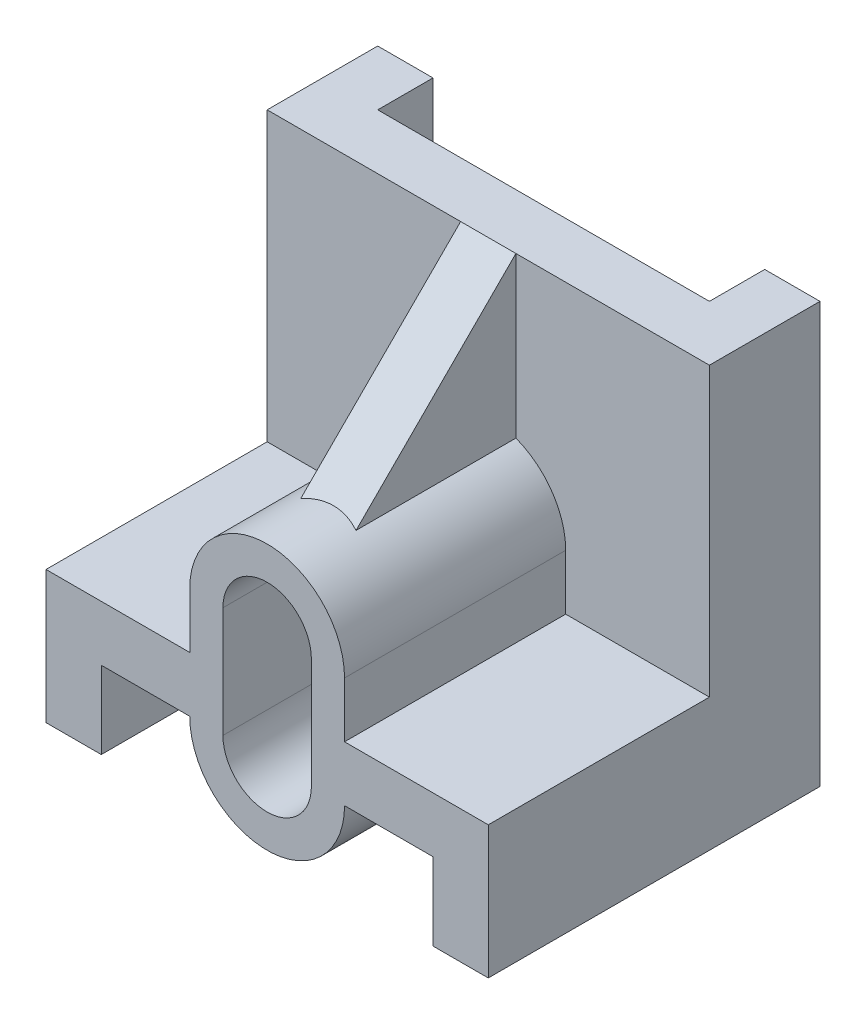
ISO-10303-21;
HEADER;
FILE_DESCRIPTION(('STEP AP214'),'2;1');
FILE_NAME('part.step','',(''),(''),'','','');
FILE_SCHEMA(('AUTOMOTIVE_DESIGN { 1 0 10303 214 1 1 1 1 }'));
ENDSEC;
DATA;
#1=APPLICATION_CONTEXT('core data for automotive mechanical design processes');
#2=APPLICATION_PROTOCOL_DEFINITION('international standard','automotive_design',2000,#1);
#3=PRODUCT_CONTEXT('',#1,'mechanical');
#4=PRODUCT('Part','Part','',(#3));
#5=PRODUCT_RELATED_PRODUCT_CATEGORY('part','',(#4));
#6=PRODUCT_DEFINITION_FORMATION('','',#4);
#7=PRODUCT_DEFINITION_CONTEXT('part definition',#1,'design');
#8=PRODUCT_DEFINITION('design','',#6,#7);
#9=PRODUCT_DEFINITION_SHAPE('','',#8);
#10=(LENGTH_UNIT() NAMED_UNIT(*) SI_UNIT(.MILLI.,.METRE.));
#11=(NAMED_UNIT(*) PLANE_ANGLE_UNIT() SI_UNIT($,.RADIAN.));
#12=(NAMED_UNIT(*) SI_UNIT($,.STERADIAN.) SOLID_ANGLE_UNIT());
#13=UNCERTAINTY_MEASURE_WITH_UNIT(LENGTH_MEASURE(1.E-05),#10,'distance_accuracy_value','');
#14=(GEOMETRIC_REPRESENTATION_CONTEXT(3) GLOBAL_UNCERTAINTY_ASSIGNED_CONTEXT((#13)) GLOBAL_UNIT_ASSIGNED_CONTEXT((#10,
#11,#12)) REPRESENTATION_CONTEXT('',''));
#15=CARTESIAN_POINT('',(0.,0.,0.));
#16=DIRECTION('',(0.,0.,1.));
#17=DIRECTION('',(1.,0.,0.));
#18=AXIS2_PLACEMENT_3D('',#15,#16,#17);
#19=CARTESIAN_POINT('',(20.,12.,10.));
#20=DIRECTION('',(0.,0.,-1.));
#21=DIRECTION('',(0.,1.,0.));
#22=AXIS2_PLACEMENT_3D('',#19,#20,#21);
#23=PLANE('',#22);
#24=DIRECTION('',(0.,-1.,0.));
#25=VECTOR('',#24,1.);
#26=CARTESIAN_POINT('',(-2.5,12.,10.));
#27=LINE('',#26,#25);
#28=CARTESIAN_POINT('',(-2.5,38.,10.));
#29=VERTEX_POINT('',#28);
#30=CARTESIAN_POINT('',(-2.5,23.538348415311,10.));
#31=VERTEX_POINT('',#30);
#32=EDGE_CURVE('E51',#29,#31,#27,.T.);
#33=ORIENTED_EDGE('',*,*,#32,.F.);
#34=DIRECTION('',(-1.,0.,0.));
#35=VECTOR('',#34,1.);
#36=CARTESIAN_POINT('',(20.,38.,10.));
#37=LINE('',#36,#35);
#38=CARTESIAN_POINT('',(-20.,38.,10.));
#39=VERTEX_POINT('',#38);
#40=EDGE_CURVE('E224',#29,#39,#37,.T.);
#41=ORIENTED_EDGE('',*,*,#40,.T.);
#42=DIRECTION('',(0.,-1.,0.));
#43=VECTOR('',#42,1.);
#44=CARTESIAN_POINT('',(-20.,12.,10.));
#45=LINE('',#44,#43);
#46=CARTESIAN_POINT('',(-20.,12.,10.));
#47=VERTEX_POINT('',#46);
#48=EDGE_CURVE('E267',#39,#47,#45,.T.);
#49=ORIENTED_EDGE('',*,*,#48,.T.);
#50=DIRECTION('',(-1.,0.,0.));
#51=VECTOR('',#50,1.);
#52=CARTESIAN_POINT('',(20.,12.,10.));
#53=LINE('',#52,#51);
#54=CARTESIAN_POINT('',(-7.,12.,10.));
#55=VERTEX_POINT('',#54);
#56=EDGE_CURVE('E235',#55,#47,#53,.T.);
#57=ORIENTED_EDGE('',*,*,#56,.F.);
#58=DIRECTION('',(0.,1.,0.));
#59=VECTOR('',#58,1.);
#60=CARTESIAN_POINT('',(-7.,12.,10.));
#61=LINE('',#60,#59);
#62=CARTESIAN_POINT('',(-7.,17.,9.99999999999999));
#63=VERTEX_POINT('',#62);
#64=EDGE_CURVE('E313',#55,#63,#61,.T.);
#65=ORIENTED_EDGE('',*,*,#64,.T.);
#66=CARTESIAN_POINT('',(0.,17.,10.));
#67=DIRECTION('',(0.,0.,-1.));
#68=DIRECTION('',(0.,1.,0.));
#69=AXIS2_PLACEMENT_3D('',#66,#67,#68);
#70=CIRCLE('',#69,7.);
#71=EDGE_CURVE('E227',#63,#31,#70,.T.);
#72=ORIENTED_EDGE('',*,*,#71,.T.);
#73=EDGE_LOOP('',(#33,#41,#49,#57,#65,#72));
#74=FACE_BOUND('',#73,.T.);
#75=ADVANCED_FACE('F36',(#74),#23,.F.);
#76=CARTESIAN_POINT('',(20.,38.,0.));
#77=DIRECTION('',(0.,0.,1.));
#78=DIRECTION('',(0.,-1.,0.));
#79=AXIS2_PLACEMENT_3D('',#76,#77,#78);
#80=PLANE('',#79);
#81=DIRECTION('',(-1.,0.,0.));
#82=VECTOR('',#81,1.);
#83=CARTESIAN_POINT('',(20.,38.,0.));
#84=LINE('',#83,#82);
#85=CARTESIAN_POINT('',(-15.,38.,0.));
#86=VERTEX_POINT('',#85);
#87=CARTESIAN_POINT('',(-20.,38.,0.));
#88=VERTEX_POINT('',#87);
#89=EDGE_CURVE('E253',#86,#88,#84,.T.);
#90=ORIENTED_EDGE('',*,*,#89,.F.);
#91=DIRECTION('',(0.,-1.,0.));
#92=VECTOR('',#91,1.);
#93=CARTESIAN_POINT('',(-15.,0.,0.));
#94=LINE('',#93,#92);
#95=CARTESIAN_POINT('',(-15.,0.,0.));
#96=VERTEX_POINT('',#95);
#97=EDGE_CURVE('E294',#86,#96,#94,.T.);
#98=ORIENTED_EDGE('',*,*,#97,.T.);
#99=DIRECTION('',(-1.,0.,0.));
#100=VECTOR('',#99,1.);
#101=CARTESIAN_POINT('',(20.,0.,0.));
#102=LINE('',#101,#100);
#103=CARTESIAN_POINT('',(-20.,0.,0.));
#104=VERTEX_POINT('',#103);
#105=EDGE_CURVE('E249',#96,#104,#102,.T.);
#106=ORIENTED_EDGE('',*,*,#105,.T.);
#107=DIRECTION('',(0.,1.,0.));
#108=VECTOR('',#107,1.);
#109=CARTESIAN_POINT('',(-20.,38.,0.));
#110=LINE('',#109,#108);
#111=EDGE_CURVE('E254',#104,#88,#110,.T.);
#112=ORIENTED_EDGE('',*,*,#111,.T.);
#113=EDGE_LOOP('',(#90,#98,#106,#112));
#114=FACE_BOUND('',#113,.T.);
#115=ADVANCED_FACE('F449',(#114),#80,.F.);
#116=CARTESIAN_POINT('',(20.,12.,30.));
#117=DIRECTION('',(0.,-1.,0.));
#118=DIRECTION('',(0.,0.,-1.));
#119=AXIS2_PLACEMENT_3D('',#116,#117,#118);
#120=PLANE('',#119);
#121=CARTESIAN_POINT('',(20.,12.,10.));
#122=VERTEX_POINT('',#121);
#123=CARTESIAN_POINT('',(7.,12.,10.));
#124=VERTEX_POINT('',#123);
#125=EDGE_CURVE('E233',#122,#124,#53,.T.);
#126=ORIENTED_EDGE('',*,*,#125,.T.);
#127=DIRECTION('',(0.,0.,1.));
#128=VECTOR('',#127,1.);
#129=CARTESIAN_POINT('',(7.,12.,30.));
#130=LINE('',#129,#128);
#131=CARTESIAN_POINT('',(7.,12.,30.));
#132=VERTEX_POINT('',#131);
#133=EDGE_CURVE('E310',#124,#132,#130,.T.);
#134=ORIENTED_EDGE('',*,*,#133,.T.);
#135=DIRECTION('',(-1.,0.,0.));
#136=VECTOR('',#135,1.);
#137=CARTESIAN_POINT('',(20.,12.,30.));
#138=LINE('',#137,#136);
#139=CARTESIAN_POINT('',(20.,12.,30.));
#140=VERTEX_POINT('',#139);
#141=EDGE_CURVE('E238',#140,#132,#138,.T.);
#142=ORIENTED_EDGE('',*,*,#141,.F.);
#143=DIRECTION('',(0.,0.,1.));
#144=VECTOR('',#143,1.);
#145=CARTESIAN_POINT('',(20.,12.,30.));
#146=LINE('',#145,#144);
#147=EDGE_CURVE('E277',#122,#140,#146,.T.);
#148=ORIENTED_EDGE('',*,*,#147,.F.);
#149=EDGE_LOOP('',(#126,#134,#142,#148));
#150=FACE_BOUND('',#149,.T.);
#151=ADVANCED_FACE('F405',(#150),#120,.F.);
#152=CARTESIAN_POINT('',(-15.,7.,0.));
#153=DIRECTION('',(0.,1.,0.));
#154=DIRECTION('',(0.,0.,1.));
#155=AXIS2_PLACEMENT_3D('',#152,#153,#154);
#156=PLANE('',#155);
#157=DIRECTION('',(0.,0.,1.));
#158=VECTOR('',#157,1.);
#159=CARTESIAN_POINT('',(7.,7.,-27.7848879788996));
#160=LINE('',#159,#158);
#161=CARTESIAN_POINT('',(7.,7.,4.99999999999999));
#162=VERTEX_POINT('',#161);
#163=CARTESIAN_POINT('',(7.,7.,30.));
#164=VERTEX_POINT('',#163);
#165=EDGE_CURVE('E324',#162,#164,#160,.T.);
#166=ORIENTED_EDGE('',*,*,#165,.F.);
#167=DIRECTION('',(1.,0.,0.));
#168=VECTOR('',#167,1.);
#169=CARTESIAN_POINT('',(-15.,7.,5.));
#170=LINE('',#169,#168);
#171=CARTESIAN_POINT('',(15.,7.,5.));
#172=VERTEX_POINT('',#171);
#173=EDGE_CURVE('E59',#162,#172,#170,.T.);
#174=ORIENTED_EDGE('',*,*,#173,.T.);
#175=DIRECTION('',(0.,0.,1.));
#176=VECTOR('',#175,1.);
#177=CARTESIAN_POINT('',(15.,7.,0.));
#178=LINE('',#177,#176);
#179=CARTESIAN_POINT('',(15.,7.,30.));
#180=VERTEX_POINT('',#179);
#181=EDGE_CURVE('E288',#172,#180,#178,.T.);
#182=ORIENTED_EDGE('',*,*,#181,.T.);
#183=DIRECTION('',(-1.,0.,0.));
#184=VECTOR('',#183,1.);
#185=CARTESIAN_POINT('',(-15.,7.,30.));
#186=LINE('',#185,#184);
#187=EDGE_CURVE('E291',#180,#164,#186,.T.);
#188=ORIENTED_EDGE('',*,*,#187,.T.);
#189=EDGE_LOOP('',(#166,#174,#182,#188));
#190=FACE_BOUND('',#189,.T.);
#191=ADVANCED_FACE('F430',(#190),#156,.F.);
#192=CARTESIAN_POINT('',(20.,0.,0.));
#193=DIRECTION('',(0.,1.,0.));
#194=DIRECTION('',(0.,0.,1.));
#195=AXIS2_PLACEMENT_3D('',#192,#193,#194);
#196=PLANE('',#195);
#197=ORIENTED_EDGE('',*,*,#105,.F.);
#198=DIRECTION('',(0.,0.,1.));
#199=VECTOR('',#198,1.);
#200=CARTESIAN_POINT('',(-15.,0.,0.));
#201=LINE('',#200,#199);
#202=CARTESIAN_POINT('',(-15.,0.,30.));
#203=VERTEX_POINT('',#202);
#204=EDGE_CURVE('E283',#96,#203,#201,.T.);
#205=ORIENTED_EDGE('',*,*,#204,.T.);
#206=DIRECTION('',(-1.,0.,0.));
#207=VECTOR('',#206,1.);
#208=CARTESIAN_POINT('',(20.,0.,30.));
#209=LINE('',#208,#207);
#210=CARTESIAN_POINT('',(-20.,0.,30.));
#211=VERTEX_POINT('',#210);
#212=EDGE_CURVE('E245',#203,#211,#209,.T.);
#213=ORIENTED_EDGE('',*,*,#212,.T.);
#214=DIRECTION('',(0.,0.,-1.));
#215=VECTOR('',#214,1.);
#216=CARTESIAN_POINT('',(-20.,0.,0.));
#217=LINE('',#216,#215);
#218=EDGE_CURVE('E258',#211,#104,#217,.T.);
#219=ORIENTED_EDGE('',*,*,#218,.T.);
#220=EDGE_LOOP('',(#197,#205,#213,#219));
#221=FACE_BOUND('',#220,.T.);
#222=ADVANCED_FACE('F467',(#221),#196,.F.);
#223=CARTESIAN_POINT('',(20.,38.,10.));
#224=DIRECTION('',(0.,-1.,0.));
#225=DIRECTION('',(0.,0.,-1.));
#226=AXIS2_PLACEMENT_3D('',#223,#224,#225);
#227=PLANE('',#226);
#228=DIRECTION('',(0.,0.,-1.));
#229=VECTOR('',#228,1.);
#230=CARTESIAN_POINT('',(15.,38.,0.));
#231=LINE('',#230,#229);
#232=CARTESIAN_POINT('',(15.,38.,5.));
#233=VERTEX_POINT('',#232);
#234=CARTESIAN_POINT('',(15.,38.,0.));
#235=VERTEX_POINT('',#234);
#236=EDGE_CURVE('E373',#233,#235,#231,.T.);
#237=ORIENTED_EDGE('',*,*,#236,.F.);
#238=DIRECTION('',(1.,0.,0.));
#239=VECTOR('',#238,1.);
#240=CARTESIAN_POINT('',(-15.,38.,5.));
#241=LINE('',#240,#239);
#242=CARTESIAN_POINT('',(-15.,38.,5.));
#243=VERTEX_POINT('',#242);
#244=EDGE_CURVE('E378',#243,#233,#241,.T.);
#245=ORIENTED_EDGE('',*,*,#244,.F.);
#246=DIRECTION('',(0.,0.,1.));
#247=VECTOR('',#246,1.);
#248=CARTESIAN_POINT('',(-15.,38.,0.));
#249=LINE('',#248,#247);
#250=EDGE_CURVE('E215',#86,#243,#249,.T.);
#251=ORIENTED_EDGE('',*,*,#250,.F.);
#252=ORIENTED_EDGE('',*,*,#89,.T.);
#253=DIRECTION('',(0.,0.,1.));
#254=VECTOR('',#253,1.);
#255=CARTESIAN_POINT('',(-20.,38.,10.));
#256=LINE('',#255,#254);
#257=EDGE_CURVE('E232',#88,#39,#256,.T.);
#258=ORIENTED_EDGE('',*,*,#257,.T.);
#259=ORIENTED_EDGE('',*,*,#40,.F.);
#260=DIRECTION('',(1.,0.,0.));
#261=VECTOR('',#260,1.);
#262=CARTESIAN_POINT('',(20.,38.,10.));
#263=LINE('',#262,#261);
#264=CARTESIAN_POINT('',(2.5,38.,10.));
#265=VERTEX_POINT('',#264);
#266=EDGE_CURVE('E205',#29,#265,#263,.T.);
#267=ORIENTED_EDGE('',*,*,#266,.T.);
#268=CARTESIAN_POINT('',(20.,38.,10.));
#269=VERTEX_POINT('',#268);
#270=EDGE_CURVE('E44',#269,#265,#37,.T.);
#271=ORIENTED_EDGE('',*,*,#270,.F.);
#272=DIRECTION('',(0.,0.,1.));
#273=VECTOR('',#272,1.);
#274=CARTESIAN_POINT('',(20.,38.,10.));
#275=LINE('',#274,#273);
#276=CARTESIAN_POINT('',(20.,38.,0.));
#277=VERTEX_POINT('',#276);
#278=EDGE_CURVE('E257',#277,#269,#275,.T.);
#279=ORIENTED_EDGE('',*,*,#278,.F.);
#280=EDGE_CURVE('E250',#277,#235,#84,.T.);
#281=ORIENTED_EDGE('',*,*,#280,.T.);
#282=EDGE_LOOP('',(#237,#245,#251,#252,#258,#259,#267,#271,#279,#281));
#283=FACE_BOUND('',#282,.T.);
#284=ADVANCED_FACE('F38',(#283),#227,.F.);
#285=ORIENTED_EDGE('',*,*,#270,.T.);
#286=DIRECTION('',(0.,-1.,0.));
#287=VECTOR('',#286,1.);
#288=CARTESIAN_POINT('',(2.5,12.,10.));
#289=LINE('',#288,#287);
#290=CARTESIAN_POINT('',(2.5,23.538348415311,10.));
#291=VERTEX_POINT('',#290);
#292=EDGE_CURVE('E385',#265,#291,#289,.T.);
#293=ORIENTED_EDGE('',*,*,#292,.T.);
#294=CARTESIAN_POINT('',(7.,17.,9.99999999999999));
#295=VERTEX_POINT('',#294);
#296=EDGE_CURVE('E306',#291,#295,#70,.T.);
#297=ORIENTED_EDGE('',*,*,#296,.T.);
#298=DIRECTION('',(0.,-1.,0.));
#299=VECTOR('',#298,1.);
#300=CARTESIAN_POINT('',(7.,12.,10.));
#301=LINE('',#300,#299);
#302=EDGE_CURVE('E307',#295,#124,#301,.T.);
#303=ORIENTED_EDGE('',*,*,#302,.T.);
#304=ORIENTED_EDGE('',*,*,#125,.F.);
#305=DIRECTION('',(0.,-1.,0.));
#306=VECTOR('',#305,1.);
#307=CARTESIAN_POINT('',(20.,12.,10.));
#308=LINE('',#307,#306);
#309=EDGE_CURVE('E279',#269,#122,#308,.T.);
#310=ORIENTED_EDGE('',*,*,#309,.F.);
#311=EDGE_LOOP('',(#285,#293,#297,#303,#304,#310));
#312=FACE_BOUND('',#311,.T.);
#313=ADVANCED_FACE('F399',(#312),#23,.F.);
#314=CARTESIAN_POINT('',(-7.,12.,30.));
#315=VERTEX_POINT('',#314);
#316=CARTESIAN_POINT('',(-20.,12.,30.));
#317=VERTEX_POINT('',#316);
#318=EDGE_CURVE('E241',#315,#317,#138,.T.);
#319=ORIENTED_EDGE('',*,*,#318,.F.);
#320=DIRECTION('',(0.,0.,-1.));
#321=VECTOR('',#320,1.);
#322=CARTESIAN_POINT('',(-7.,12.,30.));
#323=LINE('',#322,#321);
#324=EDGE_CURVE('E315',#315,#55,#323,.T.);
#325=ORIENTED_EDGE('',*,*,#324,.T.);
#326=ORIENTED_EDGE('',*,*,#56,.T.);
#327=DIRECTION('',(0.,0.,1.));
#328=VECTOR('',#327,1.);
#329=CARTESIAN_POINT('',(-20.,12.,30.));
#330=LINE('',#329,#328);
#331=EDGE_CURVE('E264',#47,#317,#330,.T.);
#332=ORIENTED_EDGE('',*,*,#331,.T.);
#333=EDGE_LOOP('',(#319,#325,#326,#332));
#334=FACE_BOUND('',#333,.T.);
#335=ADVANCED_FACE('F460',(#334),#120,.F.);
#336=CARTESIAN_POINT('',(20.,0.,30.));
#337=DIRECTION('',(0.,0.,-1.));
#338=DIRECTION('',(-1.,0.,0.));
#339=AXIS2_PLACEMENT_3D('',#336,#337,#338);
#340=PLANE('',#339);
#341=CARTESIAN_POINT('',(0.,7.,30.));
#342=DIRECTION('',(0.,0.,1.));
#343=DIRECTION('',(1.,0.,0.));
#344=AXIS2_PLACEMENT_3D('',#341,#342,#343);
#345=CIRCLE('',#344,7.);
#346=CARTESIAN_POINT('',(-7.,7.,30.));
#347=VERTEX_POINT('',#346);
#348=EDGE_CURVE('E330',#347,#164,#345,.T.);
#349=ORIENTED_EDGE('',*,*,#348,.T.);
#350=ORIENTED_EDGE('',*,*,#187,.F.);
#351=DIRECTION('',(0.,1.,0.));
#352=VECTOR('',#351,1.);
#353=CARTESIAN_POINT('',(15.,0.,30.));
#354=LINE('',#353,#352);
#355=CARTESIAN_POINT('',(15.,0.,30.));
#356=VERTEX_POINT('',#355);
#357=EDGE_CURVE('E296',#356,#180,#354,.T.);
#358=ORIENTED_EDGE('',*,*,#357,.F.);
#359=CARTESIAN_POINT('',(20.,0.,30.));
#360=VERTEX_POINT('',#359);
#361=EDGE_CURVE('E242',#360,#356,#209,.T.);
#362=ORIENTED_EDGE('',*,*,#361,.F.);
#363=DIRECTION('',(0.,-1.,0.));
#364=VECTOR('',#363,1.);
#365=CARTESIAN_POINT('',(20.,0.,30.));
#366=LINE('',#365,#364);
#367=EDGE_CURVE('E275',#140,#360,#366,.T.);
#368=ORIENTED_EDGE('',*,*,#367,.F.);
#369=ORIENTED_EDGE('',*,*,#141,.T.);
#370=DIRECTION('',(0.,1.,0.));
#371=VECTOR('',#370,1.);
#372=CARTESIAN_POINT('',(7.,17.,30.));
#373=LINE('',#372,#371);
#374=CARTESIAN_POINT('',(7.,17.,30.));
#375=VERTEX_POINT('',#374);
#376=EDGE_CURVE('E322',#132,#375,#373,.T.);
#377=ORIENTED_EDGE('',*,*,#376,.T.);
#378=CARTESIAN_POINT('',(0.,17.,30.));
#379=DIRECTION('',(0.,0.,1.));
#380=DIRECTION('',(1.,0.,0.));
#381=AXIS2_PLACEMENT_3D('',#378,#379,#380);
#382=CIRCLE('',#381,7.);
#383=CARTESIAN_POINT('',(-7.,17.,30.));
#384=VERTEX_POINT('',#383);
#385=EDGE_CURVE('E334',#375,#384,#382,.T.);
#386=ORIENTED_EDGE('',*,*,#385,.T.);
#387=DIRECTION('',(0.,-1.,0.));
#388=VECTOR('',#387,1.);
#389=CARTESIAN_POINT('',(-7.,17.,30.));
#390=LINE('',#389,#388);
#391=EDGE_CURVE('E332',#384,#315,#390,.T.);
#392=ORIENTED_EDGE('',*,*,#391,.T.);
#393=ORIENTED_EDGE('',*,*,#318,.T.);
#394=DIRECTION('',(0.,-1.,0.));
#395=VECTOR('',#394,1.);
#396=CARTESIAN_POINT('',(-20.,0.,30.));
#397=LINE('',#396,#395);
#398=EDGE_CURVE('E261',#317,#211,#397,.T.);
#399=ORIENTED_EDGE('',*,*,#398,.T.);
#400=ORIENTED_EDGE('',*,*,#212,.F.);
#401=DIRECTION('',(0.,-1.,0.));
#402=VECTOR('',#401,1.);
#403=CARTESIAN_POINT('',(-15.,0.,30.));
#404=LINE('',#403,#402);
#405=CARTESIAN_POINT('',(-15.,7.,30.));
#406=VERTEX_POINT('',#405);
#407=EDGE_CURVE('E299',#406,#203,#404,.T.);
#408=ORIENTED_EDGE('',*,*,#407,.F.);
#409=EDGE_CURVE('E295',#347,#406,#186,.T.);
#410=ORIENTED_EDGE('',*,*,#409,.F.);
#411=EDGE_LOOP('',(#349,#350,#358,#362,#368,#369,#377,#386,#392,#393,#399,#400,#408,#410));
#412=FACE_BOUND('',#411,.T.);
#413=DIRECTION('',(0.,1.,0.));
#414=VECTOR('',#413,1.);
#415=CARTESIAN_POINT('',(4.,17.,30.));
#416=LINE('',#415,#414);
#417=CARTESIAN_POINT('',(4.,7.,30.));
#418=VERTEX_POINT('',#417);
#419=CARTESIAN_POINT('',(4.,17.,30.));
#420=VERTEX_POINT('',#419);
#421=EDGE_CURVE('E341',#418,#420,#416,.T.);
#422=ORIENTED_EDGE('',*,*,#421,.F.);
#423=CARTESIAN_POINT('',(0.,7.,30.));
#424=DIRECTION('',(0.,0.,1.));
#425=DIRECTION('',(1.,0.,0.));
#426=AXIS2_PLACEMENT_3D('',#423,#424,#425);
#427=CIRCLE('',#426,4.);
#428=CARTESIAN_POINT('',(-4.,7.,30.));
#429=VERTEX_POINT('',#428);
#430=EDGE_CURVE('E349',#429,#418,#427,.T.);
#431=ORIENTED_EDGE('',*,*,#430,.F.);
#432=DIRECTION('',(0.,-1.,0.));
#433=VECTOR('',#432,1.);
#434=CARTESIAN_POINT('',(-4.,17.,30.));
#435=LINE('',#434,#433);
#436=CARTESIAN_POINT('',(-4.,17.,30.));
#437=VERTEX_POINT('',#436);
#438=EDGE_CURVE('E351',#437,#429,#435,.T.);
#439=ORIENTED_EDGE('',*,*,#438,.F.);
#440=CARTESIAN_POINT('',(0.,17.,30.));
#441=DIRECTION('',(0.,0.,1.));
#442=DIRECTION('',(1.,0.,0.));
#443=AXIS2_PLACEMENT_3D('',#440,#441,#442);
#444=CIRCLE('',#443,4.);
#445=EDGE_CURVE('E354',#420,#437,#444,.T.);
#446=ORIENTED_EDGE('',*,*,#445,.F.);
#447=EDGE_LOOP('',(#422,#431,#439,#446));
#448=FACE_BOUND('',#447,.T.);
#449=ADVANCED_FACE('F409',(#412,#448),#340,.F.);
#450=ORIENTED_EDGE('',*,*,#361,.T.);
#451=DIRECTION('',(0.,0.,1.));
#452=VECTOR('',#451,1.);
#453=CARTESIAN_POINT('',(15.,0.,0.));
#454=LINE('',#453,#452);
#455=CARTESIAN_POINT('',(15.,0.,0.));
#456=VERTEX_POINT('',#455);
#457=EDGE_CURVE('E285',#456,#356,#454,.T.);
#458=ORIENTED_EDGE('',*,*,#457,.F.);
#459=CARTESIAN_POINT('',(20.,0.,0.));
#460=VERTEX_POINT('',#459);
#461=EDGE_CURVE('E246',#460,#456,#102,.T.);
#462=ORIENTED_EDGE('',*,*,#461,.F.);
#463=DIRECTION('',(0.,0.,-1.));
#464=VECTOR('',#463,1.);
#465=CARTESIAN_POINT('',(20.,0.,0.));
#466=LINE('',#465,#464);
#467=EDGE_CURVE('E273',#360,#460,#466,.T.);
#468=ORIENTED_EDGE('',*,*,#467,.F.);
#469=EDGE_LOOP('',(#450,#458,#462,#468));
#470=FACE_BOUND('',#469,.T.);
#471=ADVANCED_FACE('F470',(#470),#196,.F.);
#472=DIRECTION('',(0.,1.,0.));
#473=VECTOR('',#472,1.);
#474=CARTESIAN_POINT('',(15.,0.,0.));
#475=LINE('',#474,#473);
#476=EDGE_CURVE('E286',#456,#235,#475,.T.);
#477=ORIENTED_EDGE('',*,*,#476,.T.);
#478=ORIENTED_EDGE('',*,*,#280,.F.);
#479=DIRECTION('',(0.,1.,0.));
#480=VECTOR('',#479,1.);
#481=CARTESIAN_POINT('',(20.,38.,0.));
#482=LINE('',#481,#480);
#483=EDGE_CURVE('E271',#460,#277,#482,.T.);
#484=ORIENTED_EDGE('',*,*,#483,.F.);
#485=ORIENTED_EDGE('',*,*,#461,.T.);
#486=EDGE_LOOP('',(#477,#478,#484,#485));
#487=FACE_BOUND('',#486,.T.);
#488=ADVANCED_FACE('F422',(#487),#80,.F.);
#489=CARTESIAN_POINT('',(20.,0.,0.));
#490=DIRECTION('',(-1.,0.,0.));
#491=DIRECTION('',(0.,0.,1.));
#492=AXIS2_PLACEMENT_3D('',#489,#490,#491);
#493=PLANE('',#492);
#494=ORIENTED_EDGE('',*,*,#278,.T.);
#495=ORIENTED_EDGE('',*,*,#309,.T.);
#496=ORIENTED_EDGE('',*,*,#147,.T.);
#497=ORIENTED_EDGE('',*,*,#367,.T.);
#498=ORIENTED_EDGE('',*,*,#467,.T.);
#499=ORIENTED_EDGE('',*,*,#483,.T.);
#500=EDGE_LOOP('',(#494,#495,#496,#497,#498,#499));
#501=FACE_BOUND('',#500,.T.);
#502=ADVANCED_FACE('F415',(#501),#493,.F.);
#503=CARTESIAN_POINT('',(-20.,0.,0.));
#504=DIRECTION('',(-1.,0.,0.));
#505=DIRECTION('',(0.,0.,1.));
#506=AXIS2_PLACEMENT_3D('',#503,#504,#505);
#507=PLANE('',#506);
#508=ORIENTED_EDGE('',*,*,#257,.F.);
#509=ORIENTED_EDGE('',*,*,#111,.F.);
#510=ORIENTED_EDGE('',*,*,#218,.F.);
#511=ORIENTED_EDGE('',*,*,#398,.F.);
#512=ORIENTED_EDGE('',*,*,#331,.F.);
#513=ORIENTED_EDGE('',*,*,#48,.F.);
#514=EDGE_LOOP('',(#508,#509,#510,#511,#512,#513));
#515=FACE_BOUND('',#514,.T.);
#516=ADVANCED_FACE('F454',(#515),#507,.T.);
#517=CARTESIAN_POINT('',(-15.,0.,0.));
#518=DIRECTION('',(-1.,0.,0.));
#519=DIRECTION('',(0.,0.,1.));
#520=AXIS2_PLACEMENT_3D('',#517,#518,#519);
#521=PLANE('',#520);
#522=ORIENTED_EDGE('',*,*,#407,.T.);
#523=ORIENTED_EDGE('',*,*,#204,.F.);
#524=ORIENTED_EDGE('',*,*,#97,.F.);
#525=ORIENTED_EDGE('',*,*,#250,.T.);
#526=DIRECTION('',(0.,1.,0.));
#527=VECTOR('',#526,1.);
#528=CARTESIAN_POINT('',(-15.,0.,5.));
#529=LINE('',#528,#527);
#530=CARTESIAN_POINT('',(-15.,7.,5.));
#531=VERTEX_POINT('',#530);
#532=EDGE_CURVE('E371',#531,#243,#529,.T.);
#533=ORIENTED_EDGE('',*,*,#532,.F.);
#534=DIRECTION('',(0.,0.,1.));
#535=VECTOR('',#534,1.);
#536=CARTESIAN_POINT('',(-15.,7.,0.));
#537=LINE('',#536,#535);
#538=EDGE_CURVE('E270',#531,#406,#537,.T.);
#539=ORIENTED_EDGE('',*,*,#538,.T.);
#540=EDGE_LOOP('',(#522,#523,#524,#525,#533,#539));
#541=FACE_BOUND('',#540,.T.);
#542=ADVANCED_FACE('F444',(#541),#521,.F.);
#543=ORIENTED_EDGE('',*,*,#538,.F.);
#544=DIRECTION('',(1.,0.,0.));
#545=VECTOR('',#544,1.);
#546=CARTESIAN_POINT('',(-15.,7.,5.));
#547=LINE('',#546,#545);
#548=CARTESIAN_POINT('',(-7.,7.,5.00000000000001));
#549=VERTEX_POINT('',#548);
#550=EDGE_CURVE('E358',#531,#549,#547,.T.);
#551=ORIENTED_EDGE('',*,*,#550,.T.);
#552=DIRECTION('',(0.,0.,1.));
#553=VECTOR('',#552,1.);
#554=CARTESIAN_POINT('',(-7.,7.,-27.7848879788996));
#555=LINE('',#554,#553);
#556=EDGE_CURVE('E321',#549,#347,#555,.T.);
#557=ORIENTED_EDGE('',*,*,#556,.T.);
#558=ORIENTED_EDGE('',*,*,#409,.T.);
#559=EDGE_LOOP('',(#543,#551,#557,#558));
#560=FACE_BOUND('',#559,.T.);
#561=ADVANCED_FACE('F440',(#560),#156,.F.);
#562=CARTESIAN_POINT('',(15.,0.,0.));
#563=DIRECTION('',(1.,0.,0.));
#564=DIRECTION('',(0.,0.,-1.));
#565=AXIS2_PLACEMENT_3D('',#562,#563,#564);
#566=PLANE('',#565);
#567=ORIENTED_EDGE('',*,*,#181,.F.);
#568=DIRECTION('',(0.,1.,0.));
#569=VECTOR('',#568,1.);
#570=CARTESIAN_POINT('',(15.,0.,5.));
#571=LINE('',#570,#569);
#572=EDGE_CURVE('E370',#172,#233,#571,.T.);
#573=ORIENTED_EDGE('',*,*,#572,.T.);
#574=ORIENTED_EDGE('',*,*,#236,.T.);
#575=ORIENTED_EDGE('',*,*,#476,.F.);
#576=ORIENTED_EDGE('',*,*,#457,.T.);
#577=ORIENTED_EDGE('',*,*,#357,.T.);
#578=EDGE_LOOP('',(#567,#573,#574,#575,#576,#577));
#579=FACE_BOUND('',#578,.T.);
#580=ADVANCED_FACE('F426',(#579),#566,.F.);
#581=CARTESIAN_POINT('',(0.,7.,-27.7848879788996));
#582=DIRECTION('',(0.,0.,1.));
#583=DIRECTION('',(1.,0.,0.));
#584=AXIS2_PLACEMENT_3D('',#581,#582,#583);
#585=CYLINDRICAL_SURFACE('',#584,7.);
#586=ORIENTED_EDGE('',*,*,#165,.T.);
#587=ORIENTED_EDGE('',*,*,#348,.F.);
#588=ORIENTED_EDGE('',*,*,#556,.F.);
#589=CARTESIAN_POINT('',(0.,7.,5.));
#590=DIRECTION('',(0.,0.,1.));
#591=DIRECTION('',(1.,0.,0.));
#592=AXIS2_PLACEMENT_3D('',#589,#590,#591);
#593=CIRCLE('',#592,7.);
#594=EDGE_CURVE('E361',#162,#549,#593,.F.);
#595=ORIENTED_EDGE('',*,*,#594,.F.);
#596=EDGE_LOOP('',(#586,#587,#588,#595));
#597=FACE_BOUND('',#596,.T.);
#598=ADVANCED_FACE('F434',(#597),#585,.T.);
#599=CARTESIAN_POINT('',(0.,17.,-27.7848879788996));
#600=DIRECTION('',(0.,0.,1.));
#601=DIRECTION('',(1.,0.,0.));
#602=AXIS2_PLACEMENT_3D('',#599,#600,#601);
#603=CYLINDRICAL_SURFACE('',#602,7.);
#604=DIRECTION('',(0.,0.,1.));
#605=VECTOR('',#604,1.);
#606=CARTESIAN_POINT('',(2.5,23.538348415311,-27.7848879788996));
#607=LINE('',#606,#605);
#608=CARTESIAN_POINT('',(2.5,23.538348415311,24.461651584689));
#609=VERTEX_POINT('',#608);
#610=EDGE_CURVE('E383',#609,#291,#607,.F.);
#611=ORIENTED_EDGE('',*,*,#610,.F.);
#612=CARTESIAN_POINT('',(0.,17.,31.));
#613=DIRECTION('',(0.,0.707106781186548,0.707106781186547));
#614=DIRECTION('',(0.,-0.707106781186547,0.707106781186548));
#615=AXIS2_PLACEMENT_3D('',#612,#613,#614);
#616=ELLIPSE('',#615,9.89949493661167,7.);
#617=CARTESIAN_POINT('',(-2.5,23.538348415311,24.461651584689));
#618=VERTEX_POINT('',#617);
#619=EDGE_CURVE('E216',#618,#609,#616,.F.);
#620=ORIENTED_EDGE('',*,*,#619,.F.);
#621=DIRECTION('',(0.,0.,1.));
#622=VECTOR('',#621,1.);
#623=CARTESIAN_POINT('',(-2.5,23.538348415311,-27.7848879788996));
#624=LINE('',#623,#622);
#625=EDGE_CURVE('E219',#618,#31,#624,.F.);
#626=ORIENTED_EDGE('',*,*,#625,.T.);
#627=ORIENTED_EDGE('',*,*,#71,.F.);
#628=DIRECTION('',(0.,0.,1.));
#629=VECTOR('',#628,1.);
#630=CARTESIAN_POINT('',(-7.,17.,-27.7848879788996));
#631=LINE('',#630,#629);
#632=EDGE_CURVE('E319',#63,#384,#631,.T.);
#633=ORIENTED_EDGE('',*,*,#632,.T.);
#634=ORIENTED_EDGE('',*,*,#385,.F.);
#635=DIRECTION('',(0.,0.,1.));
#636=VECTOR('',#635,1.);
#637=CARTESIAN_POINT('',(7.,17.,-27.7848879788996));
#638=LINE('',#637,#636);
#639=EDGE_CURVE('E318',#295,#375,#638,.T.);
#640=ORIENTED_EDGE('',*,*,#639,.F.);
#641=ORIENTED_EDGE('',*,*,#296,.F.);
#642=EDGE_LOOP('',(#611,#620,#626,#627,#633,#634,#640,#641));
#643=FACE_BOUND('',#642,.T.);
#644=ADVANCED_FACE('F394',(#643),#603,.T.);
#645=CARTESIAN_POINT('',(7.,17.,-27.7848879788996));
#646=DIRECTION('',(1.,0.,0.));
#647=DIRECTION('',(0.,1.,0.));
#648=AXIS2_PLACEMENT_3D('',#645,#646,#647);
#649=PLANE('',#648);
#650=ORIENTED_EDGE('',*,*,#302,.F.);
#651=ORIENTED_EDGE('',*,*,#639,.T.);
#652=ORIENTED_EDGE('',*,*,#376,.F.);
#653=ORIENTED_EDGE('',*,*,#133,.F.);
#654=EDGE_LOOP('',(#650,#651,#652,#653));
#655=FACE_BOUND('',#654,.T.);
#656=ADVANCED_FACE('F402',(#655),#649,.T.);
#657=CARTESIAN_POINT('',(-7.,17.,-27.7848879788996));
#658=DIRECTION('',(-1.,0.,0.));
#659=DIRECTION('',(0.,-1.,0.));
#660=AXIS2_PLACEMENT_3D('',#657,#658,#659);
#661=PLANE('',#660);
#662=ORIENTED_EDGE('',*,*,#64,.F.);
#663=ORIENTED_EDGE('',*,*,#324,.F.);
#664=ORIENTED_EDGE('',*,*,#391,.F.);
#665=ORIENTED_EDGE('',*,*,#632,.F.);
#666=EDGE_LOOP('',(#662,#663,#664,#665));
#667=FACE_BOUND('',#666,.T.);
#668=ADVANCED_FACE('F464',(#667),#661,.T.);
#669=CARTESIAN_POINT('',(0.,17.,0.));
#670=DIRECTION('',(0.,0.,1.));
#671=DIRECTION('',(1.,0.,0.));
#672=AXIS2_PLACEMENT_3D('',#669,#670,#671);
#673=CYLINDRICAL_SURFACE('',#672,4.);
#674=CARTESIAN_POINT('',(0.,17.,5.));
#675=DIRECTION('',(0.,0.,1.));
#676=DIRECTION('',(1.,0.,0.));
#677=AXIS2_PLACEMENT_3D('',#674,#675,#676);
#678=CIRCLE('',#677,4.);
#679=CARTESIAN_POINT('',(-4.,17.,5.));
#680=VERTEX_POINT('',#679);
#681=CARTESIAN_POINT('',(4.,17.,5.));
#682=VERTEX_POINT('',#681);
#683=EDGE_CURVE('E363',#680,#682,#678,.F.);
#684=ORIENTED_EDGE('',*,*,#683,.T.);
#685=DIRECTION('',(0.,0.,1.));
#686=VECTOR('',#685,1.);
#687=CARTESIAN_POINT('',(4.,17.,0.));
#688=LINE('',#687,#686);
#689=EDGE_CURVE('E337',#682,#420,#688,.T.);
#690=ORIENTED_EDGE('',*,*,#689,.T.);
#691=ORIENTED_EDGE('',*,*,#445,.T.);
#692=DIRECTION('',(0.,0.,1.));
#693=VECTOR('',#692,1.);
#694=CARTESIAN_POINT('',(-4.,17.,0.));
#695=LINE('',#694,#693);
#696=EDGE_CURVE('E338',#680,#437,#695,.T.);
#697=ORIENTED_EDGE('',*,*,#696,.F.);
#698=EDGE_LOOP('',(#684,#690,#691,#697));
#699=FACE_BOUND('',#698,.T.);
#700=ADVANCED_FACE('F567',(#699),#673,.F.);
#701=CARTESIAN_POINT('',(4.,17.,0.));
#702=DIRECTION('',(1.,0.,0.));
#703=DIRECTION('',(0.,1.,0.));
#704=AXIS2_PLACEMENT_3D('',#701,#702,#703);
#705=PLANE('',#704);
#706=ORIENTED_EDGE('',*,*,#689,.F.);
#707=DIRECTION('',(0.,-1.,0.));
#708=VECTOR('',#707,1.);
#709=CARTESIAN_POINT('',(4.,17.,5.));
#710=LINE('',#709,#708);
#711=CARTESIAN_POINT('',(4.,7.,5.));
#712=VERTEX_POINT('',#711);
#713=EDGE_CURVE('E365',#682,#712,#710,.T.);
#714=ORIENTED_EDGE('',*,*,#713,.T.);
#715=DIRECTION('',(0.,0.,1.));
#716=VECTOR('',#715,1.);
#717=CARTESIAN_POINT('',(4.,7.,0.));
#718=LINE('',#717,#716);
#719=EDGE_CURVE('E343',#712,#418,#718,.T.);
#720=ORIENTED_EDGE('',*,*,#719,.T.);
#721=ORIENTED_EDGE('',*,*,#421,.T.);
#722=EDGE_LOOP('',(#706,#714,#720,#721));
#723=FACE_BOUND('',#722,.T.);
#724=ADVANCED_FACE('F561',(#723),#705,.F.);
#725=CARTESIAN_POINT('',(0.,7.,0.));
#726=DIRECTION('',(0.,0.,1.));
#727=DIRECTION('',(1.,0.,0.));
#728=AXIS2_PLACEMENT_3D('',#725,#726,#727);
#729=CYLINDRICAL_SURFACE('',#728,4.);
#730=CARTESIAN_POINT('',(0.,7.,5.));
#731=DIRECTION('',(0.,0.,1.));
#732=DIRECTION('',(1.,0.,0.));
#733=AXIS2_PLACEMENT_3D('',#730,#731,#732);
#734=CIRCLE('',#733,4.);
#735=CARTESIAN_POINT('',(-4.,7.,5.));
#736=VERTEX_POINT('',#735);
#737=EDGE_CURVE('E368',#712,#736,#734,.F.);
#738=ORIENTED_EDGE('',*,*,#737,.T.);
#739=DIRECTION('',(0.,0.,1.));
#740=VECTOR('',#739,1.);
#741=CARTESIAN_POINT('',(-4.,7.,0.));
#742=LINE('',#741,#740);
#743=EDGE_CURVE('E340',#736,#429,#742,.T.);
#744=ORIENTED_EDGE('',*,*,#743,.T.);
#745=ORIENTED_EDGE('',*,*,#430,.T.);
#746=ORIENTED_EDGE('',*,*,#719,.F.);
#747=EDGE_LOOP('',(#738,#744,#745,#746));
#748=FACE_BOUND('',#747,.T.);
#749=ADVANCED_FACE('F566',(#748),#729,.F.);
#750=CARTESIAN_POINT('',(-4.,17.,0.));
#751=DIRECTION('',(-1.,0.,0.));
#752=DIRECTION('',(0.,-1.,0.));
#753=AXIS2_PLACEMENT_3D('',#750,#751,#752);
#754=PLANE('',#753);
#755=ORIENTED_EDGE('',*,*,#743,.F.);
#756=DIRECTION('',(0.,1.,0.));
#757=VECTOR('',#756,1.);
#758=CARTESIAN_POINT('',(-4.,17.,5.));
#759=LINE('',#758,#757);
#760=EDGE_CURVE('E11',#736,#680,#759,.T.);
#761=ORIENTED_EDGE('',*,*,#760,.T.);
#762=ORIENTED_EDGE('',*,*,#696,.T.);
#763=ORIENTED_EDGE('',*,*,#438,.T.);
#764=EDGE_LOOP('',(#755,#761,#762,#763));
#765=FACE_BOUND('',#764,.T.);
#766=ADVANCED_FACE('F577',(#765),#754,.F.);
#767=CARTESIAN_POINT('',(-15.,0.,5.));
#768=DIRECTION('',(0.,0.,1.));
#769=DIRECTION('',(1.,0.,0.));
#770=AXIS2_PLACEMENT_3D('',#767,#768,#769);
#771=PLANE('',#770);
#772=ORIENTED_EDGE('',*,*,#760,.F.);
#773=ORIENTED_EDGE('',*,*,#737,.F.);
#774=ORIENTED_EDGE('',*,*,#713,.F.);
#775=ORIENTED_EDGE('',*,*,#683,.F.);
#776=EDGE_LOOP('',(#772,#773,#774,#775));
#777=FACE_BOUND('',#776,.T.);
#778=ORIENTED_EDGE('',*,*,#594,.T.);
#779=ORIENTED_EDGE('',*,*,#550,.F.);
#780=ORIENTED_EDGE('',*,*,#532,.T.);
#781=ORIENTED_EDGE('',*,*,#244,.T.);
#782=ORIENTED_EDGE('',*,*,#572,.F.);
#783=ORIENTED_EDGE('',*,*,#173,.F.);
#784=EDGE_LOOP('',(#778,#779,#780,#781,#782,#783));
#785=FACE_BOUND('',#784,.T.);
#786=ADVANCED_FACE('F427',(#777,#785),#771,.F.);
#787=CARTESIAN_POINT('',(0.,38.,10.));
#788=DIRECTION('',(0.,0.707106781186548,0.707106781186547));
#789=DIRECTION('',(0.,-0.707106781186547,0.707106781186548));
#790=AXIS2_PLACEMENT_3D('',#787,#788,#789);
#791=PLANE('',#790);
#792=ORIENTED_EDGE('',*,*,#266,.F.);
#793=DIRECTION('',(0.,-0.707106781186547,0.707106781186548));
#794=VECTOR('',#793,1.);
#795=CARTESIAN_POINT('',(-2.5,38.,10.));
#796=LINE('',#795,#794);
#797=EDGE_CURVE('E207',#29,#618,#796,.T.);
#798=ORIENTED_EDGE('',*,*,#797,.T.);
#799=ORIENTED_EDGE('',*,*,#619,.T.);
#800=DIRECTION('',(0.,-0.707106781186547,0.707106781186548));
#801=VECTOR('',#800,1.);
#802=CARTESIAN_POINT('',(2.5,38.,10.));
#803=LINE('',#802,#801);
#804=EDGE_CURVE('E210',#265,#609,#803,.T.);
#805=ORIENTED_EDGE('',*,*,#804,.F.);
#806=EDGE_LOOP('',(#792,#798,#799,#805));
#807=FACE_BOUND('',#806,.T.);
#808=ADVANCED_FACE('F206',(#807),#791,.T.);
#809=CARTESIAN_POINT('',(2.5,19.,15.));
#810=DIRECTION('',(1.,0.,0.));
#811=DIRECTION('',(0.,0.,-1.));
#812=AXIS2_PLACEMENT_3D('',#809,#810,#811);
#813=PLANE('',#812);
#814=ORIENTED_EDGE('',*,*,#804,.T.);
#815=ORIENTED_EDGE('',*,*,#610,.T.);
#816=ORIENTED_EDGE('',*,*,#292,.F.);
#817=EDGE_LOOP('',(#814,#815,#816));
#818=FACE_BOUND('',#817,.T.);
#819=ADVANCED_FACE('F391',(#818),#813,.T.);
#820=CARTESIAN_POINT('',(-2.5,19.,15.));
#821=DIRECTION('',(1.,0.,0.));
#822=DIRECTION('',(0.,0.,-1.));
#823=AXIS2_PLACEMENT_3D('',#820,#821,#822);
#824=PLANE('',#823);
#825=ORIENTED_EDGE('',*,*,#625,.F.);
#826=ORIENTED_EDGE('',*,*,#797,.F.);
#827=ORIENTED_EDGE('',*,*,#32,.T.);
#828=EDGE_LOOP('',(#825,#826,#827));
#829=FACE_BOUND('',#828,.T.);
#830=ADVANCED_FACE('F218',(#829),#824,.F.);
#831=CLOSED_SHELL('',(#75,#115,#151,#191,#222,#284,#313,#335,#449,#471,#488,#502,#516,#542,#561,
#580,#598,#644,#656,#668,#700,#724,#749,#766,#786,#808,#819,#830));
#832=MANIFOLD_SOLID_BREP('B2',#831);
#833=ADVANCED_BREP_SHAPE_REPRESENTATION('',(#18,#832),#14);
#834=SHAPE_DEFINITION_REPRESENTATION(#9,#833);
ENDSEC;
END-ISO-10303-21;
